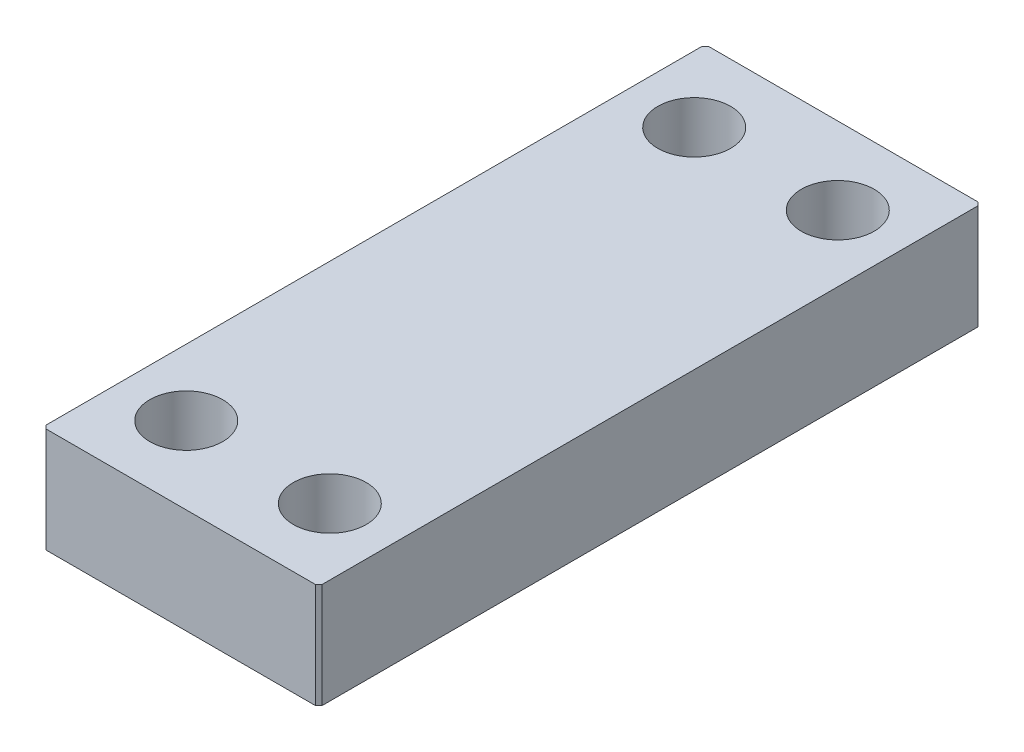
ISO-10303-21;
HEADER;
FILE_DESCRIPTION(('STEP AP214'),'2;1');
FILE_NAME('part.step','',(''),(''),'','','');
FILE_SCHEMA(('AUTOMOTIVE_DESIGN { 1 0 10303 214 1 1 1 1 }'));
ENDSEC;
DATA;
#1=APPLICATION_CONTEXT('core data for automotive mechanical design processes');
#2=APPLICATION_PROTOCOL_DEFINITION('international standard','automotive_design',2000,#1);
#3=PRODUCT_CONTEXT('',#1,'mechanical');
#4=PRODUCT('Part','Part','',(#3));
#5=PRODUCT_RELATED_PRODUCT_CATEGORY('part','',(#4));
#6=PRODUCT_DEFINITION_FORMATION('','',#4);
#7=PRODUCT_DEFINITION_CONTEXT('part definition',#1,'design');
#8=PRODUCT_DEFINITION('design','',#6,#7);
#9=PRODUCT_DEFINITION_SHAPE('','',#8);
#10=(LENGTH_UNIT() NAMED_UNIT(*) SI_UNIT(.MILLI.,.METRE.));
#11=(NAMED_UNIT(*) PLANE_ANGLE_UNIT() SI_UNIT($,.RADIAN.));
#12=(NAMED_UNIT(*) SI_UNIT($,.STERADIAN.) SOLID_ANGLE_UNIT());
#13=UNCERTAINTY_MEASURE_WITH_UNIT(LENGTH_MEASURE(1.E-05),#10,'distance_accuracy_value','');
#14=(GEOMETRIC_REPRESENTATION_CONTEXT(3) GLOBAL_UNCERTAINTY_ASSIGNED_CONTEXT((#13)) GLOBAL_UNIT_ASSIGNED_CONTEXT((#10,
#11,#12)) REPRESENTATION_CONTEXT('',''));
#15=CARTESIAN_POINT('',(0.,0.,0.));
#16=DIRECTION('',(0.,0.,1.));
#17=DIRECTION('',(1.,0.,0.));
#18=AXIS2_PLACEMENT_3D('',#15,#16,#17);
#19=CARTESIAN_POINT('',(0.,9.5,0.));
#20=DIRECTION('',(0.,-1.,0.));
#21=DIRECTION('',(0.,0.,-1.));
#22=AXIS2_PLACEMENT_3D('',#19,#20,#21);
#23=PLANE('',#22);
#24=DIRECTION('',(0.,0.,-1.));
#25=VECTOR('',#24,1.);
#26=CARTESIAN_POINT('',(12.5,9.5,-30.));
#27=LINE('',#26,#25);
#28=CARTESIAN_POINT('',(12.5,9.5,29.7));
#29=VERTEX_POINT('',#28);
#30=CARTESIAN_POINT('',(12.5,9.5,-29.7));
#31=VERTEX_POINT('',#30);
#32=EDGE_CURVE('E184',#29,#31,#27,.T.);
#33=ORIENTED_EDGE('',*,*,#32,.T.);
#34=DIRECTION('',(0.707106781186539,0.,0.707106781186556));
#35=VECTOR('',#34,1.);
#36=CARTESIAN_POINT('',(12.2,9.5,-30.));
#37=LINE('',#36,#35);
#38=CARTESIAN_POINT('',(12.2,9.5,-30.));
#39=VERTEX_POINT('',#38);
#40=EDGE_CURVE('E172',#31,#39,#37,.F.);
#41=ORIENTED_EDGE('',*,*,#40,.T.);
#42=DIRECTION('',(-1.,0.,0.));
#43=VECTOR('',#42,1.);
#44=CARTESIAN_POINT('',(12.5,9.5,-30.));
#45=LINE('',#44,#43);
#46=CARTESIAN_POINT('',(-12.2,9.5,-30.));
#47=VERTEX_POINT('',#46);
#48=EDGE_CURVE('E130',#39,#47,#45,.T.);
#49=ORIENTED_EDGE('',*,*,#48,.T.);
#50=DIRECTION('',(0.707106781186539,0.,-0.707106781186556));
#51=VECTOR('',#50,1.);
#52=CARTESIAN_POINT('',(-12.5,9.5,-29.7));
#53=LINE('',#52,#51);
#54=CARTESIAN_POINT('',(-12.5,9.5,-29.7));
#55=VERTEX_POINT('',#54);
#56=EDGE_CURVE('E169',#47,#55,#53,.F.);
#57=ORIENTED_EDGE('',*,*,#56,.T.);
#58=DIRECTION('',(0.,0.,1.));
#59=VECTOR('',#58,1.);
#60=CARTESIAN_POINT('',(-12.5,9.5,-30.));
#61=LINE('',#60,#59);
#62=CARTESIAN_POINT('',(-12.5,9.5,29.7));
#63=VERTEX_POINT('',#62);
#64=EDGE_CURVE('E139',#55,#63,#61,.T.);
#65=ORIENTED_EDGE('',*,*,#64,.T.);
#66=DIRECTION('',(-0.707106781186537,0.,-0.707106781186558));
#67=VECTOR('',#66,1.);
#68=CARTESIAN_POINT('',(-12.2,9.5,30.));
#69=LINE('',#68,#67);
#70=CARTESIAN_POINT('',(-12.2,9.5,30.));
#71=VERTEX_POINT('',#70);
#72=EDGE_CURVE('E64',#63,#71,#69,.F.);
#73=ORIENTED_EDGE('',*,*,#72,.T.);
#74=DIRECTION('',(1.,0.,0.));
#75=VECTOR('',#74,1.);
#76=CARTESIAN_POINT('',(12.5,9.5,30.));
#77=LINE('',#76,#75);
#78=CARTESIAN_POINT('',(12.2,9.5,30.));
#79=VERTEX_POINT('',#78);
#80=EDGE_CURVE('E144',#71,#79,#77,.T.);
#81=ORIENTED_EDGE('',*,*,#80,.T.);
#82=DIRECTION('',(-0.707106781186539,0.,0.707106781186556));
#83=VECTOR('',#82,1.);
#84=CARTESIAN_POINT('',(12.5,9.5,29.7));
#85=LINE('',#84,#83);
#86=EDGE_CURVE('E164',#79,#29,#85,.F.);
#87=ORIENTED_EDGE('',*,*,#86,.T.);
#88=EDGE_LOOP('',(#33,#41,#49,#57,#65,#73,#81,#87));
#89=FACE_BOUND('',#88,.T.);
#90=CARTESIAN_POINT('',(-6.5,9.5,23.));
#91=DIRECTION('',(0.,1.,0.));
#92=DIRECTION('',(0.,0.,1.));
#93=AXIS2_PLACEMENT_3D('',#90,#91,#92);
#94=CIRCLE('',#93,3.3);
#95=CARTESIAN_POINT('',(-6.5,9.5,26.3));
#96=VERTEX_POINT('',#95);
#97=EDGE_CURVE('E196',#96,#96,#94,.T.);
#98=ORIENTED_EDGE('',*,*,#97,.F.);
#99=EDGE_LOOP('',(#98));
#100=FACE_BOUND('',#99,.T.);
#101=CARTESIAN_POINT('',(6.5,9.5,-23.));
#102=DIRECTION('',(0.,1.,0.));
#103=DIRECTION('',(0.,0.,1.));
#104=AXIS2_PLACEMENT_3D('',#101,#102,#103);
#105=CIRCLE('',#104,3.3);
#106=CARTESIAN_POINT('',(6.5,9.5,-19.7));
#107=VERTEX_POINT('',#106);
#108=EDGE_CURVE('E266',#107,#107,#105,.T.);
#109=ORIENTED_EDGE('',*,*,#108,.F.);
#110=EDGE_LOOP('',(#109));
#111=FACE_BOUND('',#110,.T.);
#112=CARTESIAN_POINT('',(6.5,9.5,23.));
#113=DIRECTION('',(0.,1.,0.));
#114=DIRECTION('',(0.,0.,1.));
#115=AXIS2_PLACEMENT_3D('',#112,#113,#114);
#116=CIRCLE('',#115,3.30000000000001);
#117=CARTESIAN_POINT('',(6.5,9.5,26.3));
#118=VERTEX_POINT('',#117);
#119=EDGE_CURVE('E258',#118,#118,#116,.T.);
#120=ORIENTED_EDGE('',*,*,#119,.F.);
#121=EDGE_LOOP('',(#120));
#122=FACE_BOUND('',#121,.T.);
#123=CARTESIAN_POINT('',(-6.5,9.5,-23.));
#124=DIRECTION('',(0.,1.,0.));
#125=DIRECTION('',(0.,0.,1.));
#126=AXIS2_PLACEMENT_3D('',#123,#124,#125);
#127=CIRCLE('',#126,3.3);
#128=CARTESIAN_POINT('',(-6.5,9.5,-19.7));
#129=VERTEX_POINT('',#128);
#130=EDGE_CURVE('E247',#129,#129,#127,.T.);
#131=ORIENTED_EDGE('',*,*,#130,.F.);
#132=EDGE_LOOP('',(#131));
#133=FACE_BOUND('',#132,.T.);
#134=ADVANCED_FACE('F41',(#89,#100,#111,#122,#133),#23,.F.);
#135=CARTESIAN_POINT('',(0.,0.,0.));
#136=DIRECTION('',(0.,-1.,0.));
#137=DIRECTION('',(0.,0.,-1.));
#138=AXIS2_PLACEMENT_3D('',#135,#136,#137);
#139=PLANE('',#138);
#140=CARTESIAN_POINT('',(6.5,0.,23.));
#141=DIRECTION('',(0.,1.,0.));
#142=DIRECTION('',(0.,0.,1.));
#143=AXIS2_PLACEMENT_3D('',#140,#141,#142);
#144=CIRCLE('',#143,3.30000000000001);
#145=CARTESIAN_POINT('',(6.5,0.,26.3));
#146=VERTEX_POINT('',#145);
#147=EDGE_CURVE('E255',#146,#146,#144,.T.);
#148=ORIENTED_EDGE('',*,*,#147,.T.);
#149=EDGE_LOOP('',(#148));
#150=FACE_BOUND('',#149,.T.);
#151=CARTESIAN_POINT('',(-6.5,0.,23.));
#152=DIRECTION('',(0.,1.,0.));
#153=DIRECTION('',(0.,0.,1.));
#154=AXIS2_PLACEMENT_3D('',#151,#152,#153);
#155=CIRCLE('',#154,3.3);
#156=CARTESIAN_POINT('',(-6.5,0.,26.3));
#157=VERTEX_POINT('',#156);
#158=EDGE_CURVE('E270',#157,#157,#155,.T.);
#159=ORIENTED_EDGE('',*,*,#158,.T.);
#160=EDGE_LOOP('',(#159));
#161=FACE_BOUND('',#160,.T.);
#162=DIRECTION('',(-1.,0.,0.));
#163=VECTOR('',#162,1.);
#164=CARTESIAN_POINT('',(12.5,0.,-30.));
#165=LINE('',#164,#163);
#166=CARTESIAN_POINT('',(12.2,0.,-30.));
#167=VERTEX_POINT('',#166);
#168=CARTESIAN_POINT('',(-12.2,0.,-30.));
#169=VERTEX_POINT('',#168);
#170=EDGE_CURVE('E127',#167,#169,#165,.T.);
#171=ORIENTED_EDGE('',*,*,#170,.F.);
#172=DIRECTION('',(-0.707106781186539,0.,-0.707106781186556));
#173=VECTOR('',#172,1.);
#174=CARTESIAN_POINT('',(21.1000000000001,0.,-21.0999999999997));
#175=LINE('',#174,#173);
#176=CARTESIAN_POINT('',(12.5,0.,-29.7));
#177=VERTEX_POINT('',#176);
#178=EDGE_CURVE('E109',#167,#177,#175,.F.);
#179=ORIENTED_EDGE('',*,*,#178,.T.);
#180=DIRECTION('',(0.,0.,-1.));
#181=VECTOR('',#180,1.);
#182=CARTESIAN_POINT('',(12.5,0.,-30.));
#183=LINE('',#182,#181);
#184=CARTESIAN_POINT('',(12.5,0.,29.7));
#185=VERTEX_POINT('',#184);
#186=EDGE_CURVE('E140',#185,#177,#183,.T.);
#187=ORIENTED_EDGE('',*,*,#186,.F.);
#188=DIRECTION('',(0.707106781186539,0.,-0.707106781186556));
#189=VECTOR('',#188,1.);
#190=CARTESIAN_POINT('',(21.1000000000001,0.,21.0999999999996));
#191=LINE('',#190,#189);
#192=CARTESIAN_POINT('',(12.2,0.,30.));
#193=VERTEX_POINT('',#192);
#194=EDGE_CURVE('E132',#185,#193,#191,.F.);
#195=ORIENTED_EDGE('',*,*,#194,.T.);
#196=DIRECTION('',(1.,0.,0.));
#197=VECTOR('',#196,1.);
#198=CARTESIAN_POINT('',(12.5,0.,30.));
#199=LINE('',#198,#197);
#200=CARTESIAN_POINT('',(-12.2,0.,30.));
#201=VERTEX_POINT('',#200);
#202=EDGE_CURVE('E146',#201,#193,#199,.T.);
#203=ORIENTED_EDGE('',*,*,#202,.F.);
#204=DIRECTION('',(0.707106781186537,0.,0.707106781186558));
#205=VECTOR('',#204,1.);
#206=CARTESIAN_POINT('',(-21.1000000000002,0.,21.0999999999996));
#207=LINE('',#206,#205);
#208=CARTESIAN_POINT('',(-12.5,0.,29.7));
#209=VERTEX_POINT('',#208);
#210=EDGE_CURVE('E154',#201,#209,#207,.F.);
#211=ORIENTED_EDGE('',*,*,#210,.T.);
#212=DIRECTION('',(0.,0.,1.));
#213=VECTOR('',#212,1.);
#214=CARTESIAN_POINT('',(-12.5,0.,-30.));
#215=LINE('',#214,#213);
#216=CARTESIAN_POINT('',(-12.5,0.,-29.7));
#217=VERTEX_POINT('',#216);
#218=EDGE_CURVE('E193',#217,#209,#215,.T.);
#219=ORIENTED_EDGE('',*,*,#218,.F.);
#220=DIRECTION('',(-0.707106781186539,0.,0.707106781186556));
#221=VECTOR('',#220,1.);
#222=CARTESIAN_POINT('',(-21.1000000000001,0.,-21.0999999999997));
#223=LINE('',#222,#221);
#224=EDGE_CURVE('E121',#217,#169,#223,.F.);
#225=ORIENTED_EDGE('',*,*,#224,.T.);
#226=EDGE_LOOP('',(#171,#179,#187,#195,#203,#211,#219,#225));
#227=FACE_BOUND('',#226,.T.);
#228=CARTESIAN_POINT('',(6.5,0.,-23.));
#229=DIRECTION('',(0.,1.,0.));
#230=DIRECTION('',(0.,0.,1.));
#231=AXIS2_PLACEMENT_3D('',#228,#229,#230);
#232=CIRCLE('',#231,3.3);
#233=CARTESIAN_POINT('',(6.5,0.,-19.7));
#234=VERTEX_POINT('',#233);
#235=EDGE_CURVE('E262',#234,#234,#232,.T.);
#236=ORIENTED_EDGE('',*,*,#235,.T.);
#237=EDGE_LOOP('',(#236));
#238=FACE_BOUND('',#237,.T.);
#239=CARTESIAN_POINT('',(-6.5,0.,-23.));
#240=DIRECTION('',(0.,1.,0.));
#241=DIRECTION('',(0.,0.,1.));
#242=AXIS2_PLACEMENT_3D('',#239,#240,#241);
#243=CIRCLE('',#242,3.3);
#244=CARTESIAN_POINT('',(-6.5,0.,-19.7));
#245=VERTEX_POINT('',#244);
#246=EDGE_CURVE('E250',#245,#245,#243,.T.);
#247=ORIENTED_EDGE('',*,*,#246,.T.);
#248=EDGE_LOOP('',(#247));
#249=FACE_BOUND('',#248,.T.);
#250=ADVANCED_FACE('F135',(#150,#161,#227,#238,#249),#139,.T.);
#251=CARTESIAN_POINT('',(-12.5,9.5,-30.));
#252=DIRECTION('',(1.,0.,0.));
#253=DIRECTION('',(0.,0.,-1.));
#254=AXIS2_PLACEMENT_3D('',#251,#252,#253);
#255=PLANE('',#254);
#256=ORIENTED_EDGE('',*,*,#64,.F.);
#257=DIRECTION('',(0.,-1.,0.));
#258=VECTOR('',#257,1.);
#259=CARTESIAN_POINT('',(-12.5,9.5,-29.7));
#260=LINE('',#259,#258);
#261=EDGE_CURVE('E178',#55,#217,#260,.T.);
#262=ORIENTED_EDGE('',*,*,#261,.T.);
#263=ORIENTED_EDGE('',*,*,#218,.T.);
#264=DIRECTION('',(0.,1.,0.));
#265=VECTOR('',#264,1.);
#266=CARTESIAN_POINT('',(-12.5,9.5,29.7));
#267=LINE('',#266,#265);
#268=EDGE_CURVE('E175',#209,#63,#267,.T.);
#269=ORIENTED_EDGE('',*,*,#268,.T.);
#270=EDGE_LOOP('',(#256,#262,#263,#269));
#271=FACE_BOUND('',#270,.T.);
#272=ADVANCED_FACE('F215',(#271),#255,.F.);
#273=CARTESIAN_POINT('',(12.5,9.5,30.));
#274=DIRECTION('',(0.,0.,-1.));
#275=DIRECTION('',(-1.,0.,0.));
#276=AXIS2_PLACEMENT_3D('',#273,#274,#275);
#277=PLANE('',#276);
#278=ORIENTED_EDGE('',*,*,#80,.F.);
#279=DIRECTION('',(0.,-1.,0.));
#280=VECTOR('',#279,1.);
#281=CARTESIAN_POINT('',(-12.2,9.5,30.));
#282=LINE('',#281,#280);
#283=EDGE_CURVE('E11',#71,#201,#282,.T.);
#284=ORIENTED_EDGE('',*,*,#283,.T.);
#285=ORIENTED_EDGE('',*,*,#202,.T.);
#286=DIRECTION('',(0.,1.,0.));
#287=VECTOR('',#286,1.);
#288=CARTESIAN_POINT('',(12.2,9.5,30.));
#289=LINE('',#288,#287);
#290=EDGE_CURVE('E51',#193,#79,#289,.T.);
#291=ORIENTED_EDGE('',*,*,#290,.T.);
#292=EDGE_LOOP('',(#278,#284,#285,#291));
#293=FACE_BOUND('',#292,.T.);
#294=ADVANCED_FACE('F199',(#293),#277,.F.);
#295=CARTESIAN_POINT('',(12.5,9.5,-30.));
#296=DIRECTION('',(-1.,0.,0.));
#297=DIRECTION('',(0.,0.,1.));
#298=AXIS2_PLACEMENT_3D('',#295,#296,#297);
#299=PLANE('',#298);
#300=ORIENTED_EDGE('',*,*,#186,.T.);
#301=DIRECTION('',(0.,1.,0.));
#302=VECTOR('',#301,1.);
#303=CARTESIAN_POINT('',(12.5,9.5,-29.7));
#304=LINE('',#303,#302);
#305=EDGE_CURVE('E114',#177,#31,#304,.T.);
#306=ORIENTED_EDGE('',*,*,#305,.T.);
#307=ORIENTED_EDGE('',*,*,#32,.F.);
#308=DIRECTION('',(0.,-1.,0.));
#309=VECTOR('',#308,1.);
#310=CARTESIAN_POINT('',(12.5,9.5,29.7));
#311=LINE('',#310,#309);
#312=EDGE_CURVE('E120',#29,#185,#311,.T.);
#313=ORIENTED_EDGE('',*,*,#312,.T.);
#314=EDGE_LOOP('',(#300,#306,#307,#313));
#315=FACE_BOUND('',#314,.T.);
#316=ADVANCED_FACE('F206',(#315),#299,.F.);
#317=CARTESIAN_POINT('',(12.5,9.5,-30.));
#318=DIRECTION('',(0.,0.,1.));
#319=DIRECTION('',(1.,0.,0.));
#320=AXIS2_PLACEMENT_3D('',#317,#318,#319);
#321=PLANE('',#320);
#322=ORIENTED_EDGE('',*,*,#48,.F.);
#323=DIRECTION('',(0.,-1.,0.));
#324=VECTOR('',#323,1.);
#325=CARTESIAN_POINT('',(12.2,9.5,-30.));
#326=LINE('',#325,#324);
#327=EDGE_CURVE('E113',#39,#167,#326,.T.);
#328=ORIENTED_EDGE('',*,*,#327,.T.);
#329=ORIENTED_EDGE('',*,*,#170,.T.);
#330=DIRECTION('',(0.,1.,0.));
#331=VECTOR('',#330,1.);
#332=CARTESIAN_POINT('',(-12.2,9.5,-30.));
#333=LINE('',#332,#331);
#334=EDGE_CURVE('E133',#169,#47,#333,.T.);
#335=ORIENTED_EDGE('',*,*,#334,.T.);
#336=EDGE_LOOP('',(#322,#328,#329,#335));
#337=FACE_BOUND('',#336,.T.);
#338=ADVANCED_FACE('F126',(#337),#321,.F.);
#339=CARTESIAN_POINT('',(-6.5,9.5,23.));
#340=DIRECTION('',(0.,-1.,0.));
#341=DIRECTION('',(0.,0.,-1.));
#342=AXIS2_PLACEMENT_3D('',#339,#340,#341);
#343=CYLINDRICAL_SURFACE('',#342,3.3);
#344=ORIENTED_EDGE('',*,*,#97,.T.);
#345=EDGE_LOOP('',(#344));
#346=FACE_BOUND('',#345,.T.);
#347=ORIENTED_EDGE('',*,*,#158,.F.);
#348=EDGE_LOOP('',(#347));
#349=FACE_BOUND('',#348,.T.);
#350=ADVANCED_FACE('F213',(#346,#349),#343,.F.);
#351=CARTESIAN_POINT('',(6.5,9.5,-23.));
#352=DIRECTION('',(0.,-1.,0.));
#353=DIRECTION('',(0.,0.,-1.));
#354=AXIS2_PLACEMENT_3D('',#351,#352,#353);
#355=CYLINDRICAL_SURFACE('',#354,3.3);
#356=ORIENTED_EDGE('',*,*,#108,.T.);
#357=EDGE_LOOP('',(#356));
#358=FACE_BOUND('',#357,.T.);
#359=ORIENTED_EDGE('',*,*,#235,.F.);
#360=EDGE_LOOP('',(#359));
#361=FACE_BOUND('',#360,.T.);
#362=ADVANCED_FACE('F227',(#358,#361),#355,.F.);
#363=CARTESIAN_POINT('',(6.5,9.5,23.));
#364=DIRECTION('',(0.,-1.,0.));
#365=DIRECTION('',(0.,0.,-1.));
#366=AXIS2_PLACEMENT_3D('',#363,#364,#365);
#367=CYLINDRICAL_SURFACE('',#366,3.30000000000001);
#368=ORIENTED_EDGE('',*,*,#119,.T.);
#369=EDGE_LOOP('',(#368));
#370=FACE_BOUND('',#369,.T.);
#371=ORIENTED_EDGE('',*,*,#147,.F.);
#372=EDGE_LOOP('',(#371));
#373=FACE_BOUND('',#372,.T.);
#374=ADVANCED_FACE('F231',(#370,#373),#367,.F.);
#375=CARTESIAN_POINT('',(-6.5,9.5,-23.));
#376=DIRECTION('',(0.,-1.,0.));
#377=DIRECTION('',(0.,0.,-1.));
#378=AXIS2_PLACEMENT_3D('',#375,#376,#377);
#379=CYLINDRICAL_SURFACE('',#378,3.3);
#380=ORIENTED_EDGE('',*,*,#130,.T.);
#381=EDGE_LOOP('',(#380));
#382=FACE_BOUND('',#381,.T.);
#383=ORIENTED_EDGE('',*,*,#246,.F.);
#384=EDGE_LOOP('',(#383));
#385=FACE_BOUND('',#384,.T.);
#386=ADVANCED_FACE('F235',(#382,#385),#379,.F.);
#387=CARTESIAN_POINT('',(12.2,9.5,-30.));
#388=DIRECTION('',(-0.707106781186556,0.,0.707106781186539));
#389=DIRECTION('',(0.,-1.,0.));
#390=AXIS2_PLACEMENT_3D('',#387,#388,#389);
#391=PLANE('',#390);
#392=ORIENTED_EDGE('',*,*,#40,.F.);
#393=ORIENTED_EDGE('',*,*,#305,.F.);
#394=ORIENTED_EDGE('',*,*,#178,.F.);
#395=ORIENTED_EDGE('',*,*,#327,.F.);
#396=EDGE_LOOP('',(#392,#393,#394,#395));
#397=FACE_BOUND('',#396,.T.);
#398=ADVANCED_FACE('F112',(#397),#391,.F.);
#399=CARTESIAN_POINT('',(-12.5,9.5,-29.7));
#400=DIRECTION('',(0.707106781186556,0.,0.707106781186539));
#401=DIRECTION('',(0.,-1.,0.));
#402=AXIS2_PLACEMENT_3D('',#399,#400,#401);
#403=PLANE('',#402);
#404=ORIENTED_EDGE('',*,*,#56,.F.);
#405=ORIENTED_EDGE('',*,*,#334,.F.);
#406=ORIENTED_EDGE('',*,*,#224,.F.);
#407=ORIENTED_EDGE('',*,*,#261,.F.);
#408=EDGE_LOOP('',(#404,#405,#406,#407));
#409=FACE_BOUND('',#408,.T.);
#410=ADVANCED_FACE('F242',(#409),#403,.F.);
#411=CARTESIAN_POINT('',(-12.2,9.5,30.));
#412=DIRECTION('',(0.707106781186558,0.,-0.707106781186537));
#413=DIRECTION('',(0.,-1.,0.));
#414=AXIS2_PLACEMENT_3D('',#411,#412,#413);
#415=PLANE('',#414);
#416=ORIENTED_EDGE('',*,*,#72,.F.);
#417=ORIENTED_EDGE('',*,*,#268,.F.);
#418=ORIENTED_EDGE('',*,*,#210,.F.);
#419=ORIENTED_EDGE('',*,*,#283,.F.);
#420=EDGE_LOOP('',(#416,#417,#418,#419));
#421=FACE_BOUND('',#420,.T.);
#422=ADVANCED_FACE('F294',(#421),#415,.F.);
#423=CARTESIAN_POINT('',(12.5,9.5,29.7));
#424=DIRECTION('',(-0.707106781186556,0.,-0.707106781186539));
#425=DIRECTION('',(0.,-1.,0.));
#426=AXIS2_PLACEMENT_3D('',#423,#424,#425);
#427=PLANE('',#426);
#428=ORIENTED_EDGE('',*,*,#86,.F.);
#429=ORIENTED_EDGE('',*,*,#290,.F.);
#430=ORIENTED_EDGE('',*,*,#194,.F.);
#431=ORIENTED_EDGE('',*,*,#312,.F.);
#432=EDGE_LOOP('',(#428,#429,#430,#431));
#433=FACE_BOUND('',#432,.T.);
#434=ADVANCED_FACE('F44',(#433),#427,.F.);
#435=CLOSED_SHELL('',(#134,#250,#272,#294,#316,#338,#350,#362,#374,#386,#398,#410,#422,#434));
#436=MANIFOLD_SOLID_BREP('B2',#435);
#437=ADVANCED_BREP_SHAPE_REPRESENTATION('',(#18,#436),#14);
#438=SHAPE_DEFINITION_REPRESENTATION(#9,#437);
ENDSEC;
END-ISO-10303-21;
